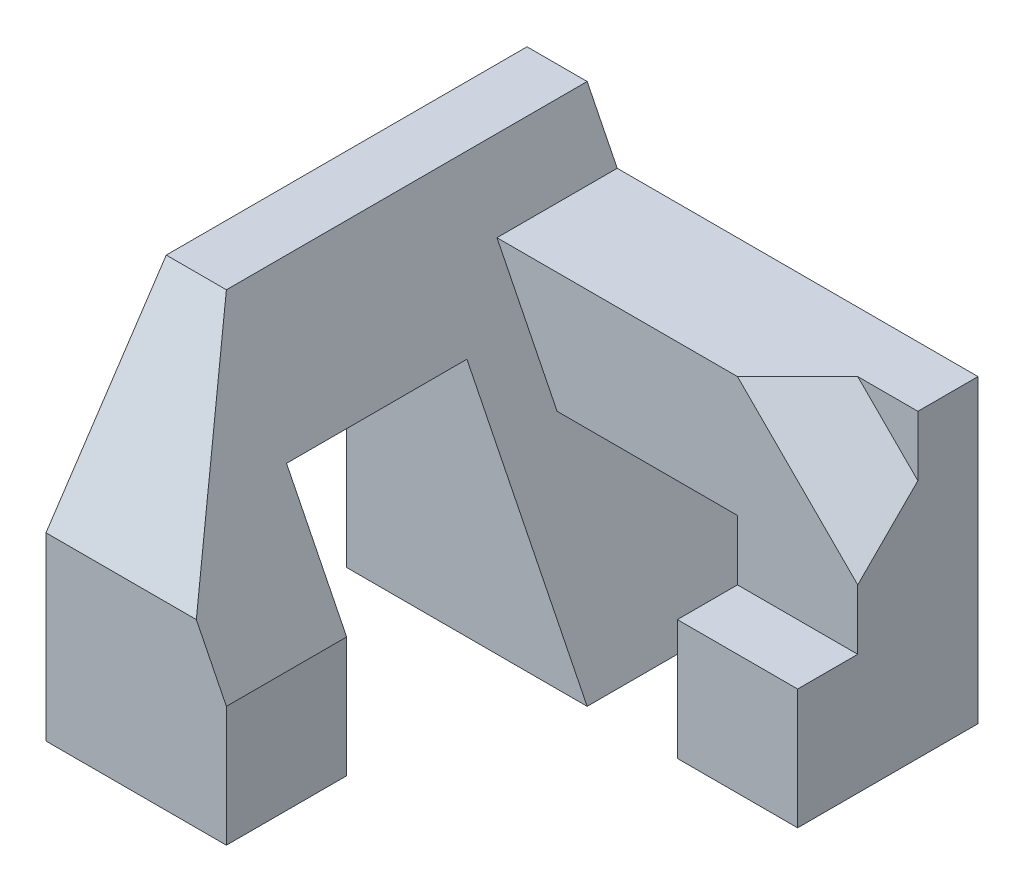
ISO-10303-21;
HEADER;
FILE_DESCRIPTION(('STEP AP214'),'2;1');
FILE_NAME('part.step','',(''),(''),'','','');
FILE_SCHEMA(('AUTOMOTIVE_DESIGN { 1 0 10303 214 1 1 1 1 }'));
ENDSEC;
DATA;
#1=APPLICATION_CONTEXT('core data for automotive mechanical design processes');
#2=APPLICATION_PROTOCOL_DEFINITION('international standard','automotive_design',2000,#1);
#3=PRODUCT_CONTEXT('',#1,'mechanical');
#4=PRODUCT('Part','Part','',(#3));
#5=PRODUCT_RELATED_PRODUCT_CATEGORY('part','',(#4));
#6=PRODUCT_DEFINITION_FORMATION('','',#4);
#7=PRODUCT_DEFINITION_CONTEXT('part definition',#1,'design');
#8=PRODUCT_DEFINITION('design','',#6,#7);
#9=PRODUCT_DEFINITION_SHAPE('','',#8);
#10=(LENGTH_UNIT() NAMED_UNIT(*) SI_UNIT(.MILLI.,.METRE.));
#11=(NAMED_UNIT(*) PLANE_ANGLE_UNIT() SI_UNIT($,.RADIAN.));
#12=(NAMED_UNIT(*) SI_UNIT($,.STERADIAN.) SOLID_ANGLE_UNIT());
#13=UNCERTAINTY_MEASURE_WITH_UNIT(LENGTH_MEASURE(1.E-05),#10,'distance_accuracy_value','');
#14=(GEOMETRIC_REPRESENTATION_CONTEXT(3) GLOBAL_UNCERTAINTY_ASSIGNED_CONTEXT((#13)) GLOBAL_UNIT_ASSIGNED_CONTEXT((#10,
#11,#12)) REPRESENTATION_CONTEXT('',''));
#15=CARTESIAN_POINT('',(0.,0.,0.));
#16=DIRECTION('',(0.,0.,1.));
#17=DIRECTION('',(1.,0.,0.));
#18=AXIS2_PLACEMENT_3D('',#15,#16,#17);
#19=CARTESIAN_POINT('',(4.,0.,2.));
#20=DIRECTION('',(0.,0.,-1.));
#21=DIRECTION('',(-1.,0.,0.));
#22=AXIS2_PLACEMENT_3D('',#19,#20,#21);
#23=PLANE('',#22);
#24=DIRECTION('',(0.,-1.,0.));
#25=VECTOR('',#24,1.);
#26=CARTESIAN_POINT('',(5.5,2.,2.));
#27=LINE('',#26,#25);
#28=CARTESIAN_POINT('',(5.5,0.,2.));
#29=VERTEX_POINT('',#28);
#30=CARTESIAN_POINT('',(5.5,-0.999999999999999,2.));
#31=VERTEX_POINT('',#30);
#32=EDGE_CURVE('E183',#29,#31,#27,.T.);
#33=ORIENTED_EDGE('',*,*,#32,.F.);
#34=DIRECTION('',(0.707106781186547,-0.707106781186548,0.));
#35=VECTOR('',#34,1.);
#36=CARTESIAN_POINT('',(3.5,2.,2.));
#37=LINE('',#36,#35);
#38=CARTESIAN_POINT('',(3.5,2.,2.));
#39=VERTEX_POINT('',#38);
#40=EDGE_CURVE('E172',#39,#29,#37,.T.);
#41=ORIENTED_EDGE('',*,*,#40,.F.);
#42=DIRECTION('',(-1.,0.,0.));
#43=VECTOR('',#42,1.);
#44=CARTESIAN_POINT('',(4.,2.,2.));
#45=LINE('',#44,#43);
#46=CARTESIAN_POINT('',(-0.5,2.,2.));
#47=VERTEX_POINT('',#46);
#48=EDGE_CURVE('E59',#39,#47,#45,.T.);
#49=ORIENTED_EDGE('',*,*,#48,.T.);
#50=DIRECTION('',(-0.447213595499958,0.894427190999916,0.));
#51=VECTOR('',#50,1.);
#52=CARTESIAN_POINT('',(0.4,0.2,2.));
#53=LINE('',#52,#51);
#54=CARTESIAN_POINT('',(0.5,0.,2.));
#55=VERTEX_POINT('',#54);
#56=EDGE_CURVE('E43',#55,#47,#53,.T.);
#57=ORIENTED_EDGE('',*,*,#56,.F.);
#58=DIRECTION('',(-1.,0.,0.));
#59=VECTOR('',#58,1.);
#60=CARTESIAN_POINT('',(4.,0.,2.));
#61=LINE('',#60,#59);
#62=CARTESIAN_POINT('',(3.5,0.,2.));
#63=VERTEX_POINT('',#62);
#64=EDGE_CURVE('E207',#63,#55,#61,.T.);
#65=ORIENTED_EDGE('',*,*,#64,.F.);
#66=DIRECTION('',(0.,1.,0.));
#67=VECTOR('',#66,1.);
#68=CARTESIAN_POINT('',(3.5,-3.,2.));
#69=LINE('',#68,#67);
#70=CARTESIAN_POINT('',(3.5,-1.,2.));
#71=VERTEX_POINT('',#70);
#72=EDGE_CURVE('E352',#71,#63,#69,.T.);
#73=ORIENTED_EDGE('',*,*,#72,.F.);
#74=DIRECTION('',(-1.,0.,0.));
#75=VECTOR('',#74,1.);
#76=CARTESIAN_POINT('',(5.5,-0.999999999999999,2.));
#77=LINE('',#76,#75);
#78=EDGE_CURVE('E189',#31,#71,#77,.T.);
#79=ORIENTED_EDGE('',*,*,#78,.F.);
#80=EDGE_LOOP('',(#33,#41,#49,#57,#65,#73,#79));
#81=FACE_BOUND('',#80,.T.);
#82=ADVANCED_FACE('F34',(#81),#23,.F.);
#83=CARTESIAN_POINT('',(4.,0.,0.));
#84=DIRECTION('',(0.,1.,0.));
#85=DIRECTION('',(-1.,0.,0.));
#86=AXIS2_PLACEMENT_3D('',#83,#84,#85);
#87=PLANE('',#86);
#88=DIRECTION('',(0.,0.,-1.));
#89=VECTOR('',#88,1.);
#90=CARTESIAN_POINT('',(3.5,0.,2.));
#91=LINE('',#90,#89);
#92=CARTESIAN_POINT('',(3.5,0.,0.));
#93=VERTEX_POINT('',#92);
#94=EDGE_CURVE('E351',#63,#93,#91,.T.);
#95=ORIENTED_EDGE('',*,*,#94,.F.);
#96=ORIENTED_EDGE('',*,*,#64,.T.);
#97=DIRECTION('',(0.,0.,1.));
#98=VECTOR('',#97,1.);
#99=CARTESIAN_POINT('',(0.499999999999999,0.,0.));
#100=LINE('',#99,#98);
#101=CARTESIAN_POINT('',(0.5,0.,0.));
#102=VERTEX_POINT('',#101);
#103=EDGE_CURVE('E285',#102,#55,#100,.T.);
#104=ORIENTED_EDGE('',*,*,#103,.F.);
#105=DIRECTION('',(-1.,0.,0.));
#106=VECTOR('',#105,1.);
#107=CARTESIAN_POINT('',(4.,0.,0.));
#108=LINE('',#107,#106);
#109=EDGE_CURVE('E194',#93,#102,#108,.T.);
#110=ORIENTED_EDGE('',*,*,#109,.F.);
#111=EDGE_LOOP('',(#95,#96,#104,#110));
#112=FACE_BOUND('',#111,.T.);
#113=ADVANCED_FACE('F350',(#112),#87,.F.);
#114=CARTESIAN_POINT('',(0.4,0.2,0.));
#115=DIRECTION('',(0.894427190999916,0.447213595499958,0.));
#116=DIRECTION('',(-0.447213595499958,0.894427190999916,0.));
#117=AXIS2_PLACEMENT_3D('',#114,#115,#116);
#118=PLANE('',#117);
#119=ORIENTED_EDGE('',*,*,#56,.T.);
#120=DIRECTION('',(0.,0.,-1.));
#121=VECTOR('',#120,1.);
#122=CARTESIAN_POINT('',(-0.5,2.,0.));
#123=LINE('',#122,#121);
#124=CARTESIAN_POINT('',(-0.5,2.,0.));
#125=VERTEX_POINT('',#124);
#126=EDGE_CURVE('E12',#47,#125,#123,.T.);
#127=ORIENTED_EDGE('',*,*,#126,.T.);
#128=DIRECTION('',(-0.447213595499958,0.894427190999916,0.));
#129=VECTOR('',#128,1.);
#130=CARTESIAN_POINT('',(2.,-3.,0.));
#131=LINE('',#130,#129);
#132=CARTESIAN_POINT('',(-1.,3.,0.));
#133=VERTEX_POINT('',#132);
#134=EDGE_CURVE('E241',#125,#133,#131,.T.);
#135=ORIENTED_EDGE('',*,*,#134,.T.);
#136=DIRECTION('',(0.,0.,1.));
#137=VECTOR('',#136,1.);
#138=CARTESIAN_POINT('',(-1.,3.,0.));
#139=LINE('',#138,#137);
#140=CARTESIAN_POINT('',(-0.999999999999997,3.,6.));
#141=VERTEX_POINT('',#140);
#142=EDGE_CURVE('E246',#133,#141,#139,.T.);
#143=ORIENTED_EDGE('',*,*,#142,.T.);
#144=DIRECTION('',(-0.384110639798688,0.768221279597376,-0.512147519731584));
#145=VECTOR('',#144,1.);
#146=CARTESIAN_POINT('',(-1.14754098360656,3.29508196721311,5.80327868852459));
#147=LINE('',#146,#145);
#148=CARTESIAN_POINT('',(0.500000000000003,0.,8.));
#149=VERTEX_POINT('',#148);
#150=EDGE_CURVE('E283',#149,#141,#147,.T.);
#151=ORIENTED_EDGE('',*,*,#150,.F.);
#152=DIRECTION('',(0.447213595499958,-0.894427190999916,0.));
#153=VECTOR('',#152,1.);
#154=CARTESIAN_POINT('',(-0.999999999999999,3.,8.));
#155=LINE('',#154,#153);
#156=CARTESIAN_POINT('',(0.999999999999999,-0.999999999999992,8.));
#157=VERTEX_POINT('',#156);
#158=EDGE_CURVE('E249',#149,#157,#155,.T.);
#159=ORIENTED_EDGE('',*,*,#158,.T.);
#160=DIRECTION('',(0.,0.,1.));
#161=VECTOR('',#160,1.);
#162=CARTESIAN_POINT('',(1.,-1.,0.));
#163=LINE('',#162,#161);
#164=CARTESIAN_POINT('',(1.,-0.999999999999997,6.));
#165=VERTEX_POINT('',#164);
#166=EDGE_CURVE('E230',#165,#157,#163,.T.);
#167=ORIENTED_EDGE('',*,*,#166,.F.);
#168=DIRECTION('',(0.447213595499958,-0.894427190999916,0.));
#169=VECTOR('',#168,1.);
#170=CARTESIAN_POINT('',(0.400000000000001,0.200000000000001,6.));
#171=LINE('',#170,#169);
#172=CARTESIAN_POINT('',(0.,1.,6.));
#173=VERTEX_POINT('',#172);
#174=EDGE_CURVE('E272',#173,#165,#171,.T.);
#175=ORIENTED_EDGE('',*,*,#174,.F.);
#176=DIRECTION('',(0.,0.,1.));
#177=VECTOR('',#176,1.);
#178=CARTESIAN_POINT('',(0.,1.,0.));
#179=LINE('',#178,#177);
#180=CARTESIAN_POINT('',(0.,1.,3.));
#181=VERTEX_POINT('',#180);
#182=EDGE_CURVE('E280',#181,#173,#179,.T.);
#183=ORIENTED_EDGE('',*,*,#182,.F.);
#184=DIRECTION('',(-0.447213595499958,0.894427190999916,0.));
#185=VECTOR('',#184,1.);
#186=CARTESIAN_POINT('',(0.400000000000001,0.2,3.));
#187=LINE('',#186,#185);
#188=CARTESIAN_POINT('',(2.,-3.,3.));
#189=VERTEX_POINT('',#188);
#190=EDGE_CURVE('E275',#189,#181,#187,.T.);
#191=ORIENTED_EDGE('',*,*,#190,.F.);
#192=DIRECTION('',(0.,0.,-1.));
#193=VECTOR('',#192,1.);
#194=CARTESIAN_POINT('',(2.,-3.,8.));
#195=LINE('',#194,#193);
#196=CARTESIAN_POINT('',(2.,-3.,0.));
#197=VERTEX_POINT('',#196);
#198=EDGE_CURVE('E266',#189,#197,#195,.T.);
#199=ORIENTED_EDGE('',*,*,#198,.T.);
#200=EDGE_CURVE('E243',#197,#102,#131,.T.);
#201=ORIENTED_EDGE('',*,*,#200,.T.);
#202=ORIENTED_EDGE('',*,*,#103,.T.);
#203=EDGE_LOOP('',(#119,#127,#135,#143,#151,#159,#167,#175,#183,#191,#199,#201,#202));
#204=FACE_BOUND('',#203,.T.);
#205=ADVANCED_FACE('F289',(#204),#118,.T.);
#206=CARTESIAN_POINT('',(2.,-3.,8.));
#207=DIRECTION('',(0.,1.,0.));
#208=DIRECTION('',(-1.,0.,0.));
#209=AXIS2_PLACEMENT_3D('',#206,#207,#208);
#210=PLANE('',#209);
#211=ORIENTED_EDGE('',*,*,#198,.F.);
#212=DIRECTION('',(-1.,0.,0.));
#213=VECTOR('',#212,1.);
#214=CARTESIAN_POINT('',(2.,-3.,3.));
#215=LINE('',#214,#213);
#216=CARTESIAN_POINT('',(-2.,-3.,3.));
#217=VERTEX_POINT('',#216);
#218=EDGE_CURVE('E238',#189,#217,#215,.T.);
#219=ORIENTED_EDGE('',*,*,#218,.T.);
#220=DIRECTION('',(0.,0.,-1.));
#221=VECTOR('',#220,1.);
#222=CARTESIAN_POINT('',(-2.,-3.,8.));
#223=LINE('',#222,#221);
#224=CARTESIAN_POINT('',(-2.,-3.,0.));
#225=VERTEX_POINT('',#224);
#226=EDGE_CURVE('E268',#217,#225,#223,.T.);
#227=ORIENTED_EDGE('',*,*,#226,.T.);
#228=DIRECTION('',(1.,0.,0.));
#229=VECTOR('',#228,1.);
#230=CARTESIAN_POINT('',(2.,-3.,0.));
#231=LINE('',#230,#229);
#232=EDGE_CURVE('E260',#225,#197,#231,.T.);
#233=ORIENTED_EDGE('',*,*,#232,.T.);
#234=EDGE_LOOP('',(#211,#219,#227,#233));
#235=FACE_BOUND('',#234,.T.);
#236=ADVANCED_FACE('F343',(#235),#210,.F.);
#237=CARTESIAN_POINT('',(2.,3.,8.));
#238=DIRECTION('',(0.,-1.,0.));
#239=DIRECTION('',(1.,0.,0.));
#240=AXIS2_PLACEMENT_3D('',#237,#238,#239);
#241=PLANE('',#240);
#242=DIRECTION('',(0.,0.,-1.));
#243=VECTOR('',#242,1.);
#244=CARTESIAN_POINT('',(-2.,3.,8.));
#245=LINE('',#244,#243);
#246=CARTESIAN_POINT('',(-2.,3.,6.));
#247=VERTEX_POINT('',#246);
#248=CARTESIAN_POINT('',(-2.,3.,0.));
#249=VERTEX_POINT('',#248);
#250=EDGE_CURVE('E258',#247,#249,#245,.T.);
#251=ORIENTED_EDGE('',*,*,#250,.F.);
#252=DIRECTION('',(-1.,0.,0.));
#253=VECTOR('',#252,1.);
#254=CARTESIAN_POINT('',(2.,3.,6.));
#255=LINE('',#254,#253);
#256=EDGE_CURVE('E212',#141,#247,#255,.T.);
#257=ORIENTED_EDGE('',*,*,#256,.F.);
#258=ORIENTED_EDGE('',*,*,#142,.F.);
#259=DIRECTION('',(-1.,0.,0.));
#260=VECTOR('',#259,1.);
#261=CARTESIAN_POINT('',(2.,3.,0.));
#262=LINE('',#261,#260);
#263=EDGE_CURVE('E255',#133,#249,#262,.T.);
#264=ORIENTED_EDGE('',*,*,#263,.T.);
#265=EDGE_LOOP('',(#251,#257,#258,#264));
#266=FACE_BOUND('',#265,.T.);
#267=ADVANCED_FACE('F309',(#266),#241,.F.);
#268=CARTESIAN_POINT('',(0.,0.,8.));
#269=DIRECTION('',(0.,0.,1.));
#270=DIRECTION('',(1.,0.,0.));
#271=AXIS2_PLACEMENT_3D('',#268,#269,#270);
#272=PLANE('',#271);
#273=DIRECTION('',(-1.,0.,0.));
#274=VECTOR('',#273,1.);
#275=CARTESIAN_POINT('',(2.,0.,8.));
#276=LINE('',#275,#274);
#277=CARTESIAN_POINT('',(-2.,0.,8.));
#278=VERTEX_POINT('',#277);
#279=EDGE_CURVE('E213',#149,#278,#276,.T.);
#280=ORIENTED_EDGE('',*,*,#279,.T.);
#281=DIRECTION('',(0.,-1.,0.));
#282=VECTOR('',#281,1.);
#283=CARTESIAN_POINT('',(-2.,-3.,8.));
#284=LINE('',#283,#282);
#285=CARTESIAN_POINT('',(-2.,-3.,8.));
#286=VERTEX_POINT('',#285);
#287=EDGE_CURVE('E252',#278,#286,#284,.T.);
#288=ORIENTED_EDGE('',*,*,#287,.T.);
#289=DIRECTION('',(1.,0.,0.));
#290=VECTOR('',#289,1.);
#291=CARTESIAN_POINT('',(2.,-3.,8.));
#292=LINE('',#291,#290);
#293=CARTESIAN_POINT('',(1.,-3.,8.));
#294=VERTEX_POINT('',#293);
#295=EDGE_CURVE('E254',#286,#294,#292,.T.);
#296=ORIENTED_EDGE('',*,*,#295,.T.);
#297=DIRECTION('',(0.,-1.,0.));
#298=VECTOR('',#297,1.);
#299=CARTESIAN_POINT('',(1.,3.,8.));
#300=LINE('',#299,#298);
#301=EDGE_CURVE('E228',#157,#294,#300,.T.);
#302=ORIENTED_EDGE('',*,*,#301,.F.);
#303=ORIENTED_EDGE('',*,*,#158,.F.);
#304=EDGE_LOOP('',(#280,#288,#296,#302,#303));
#305=FACE_BOUND('',#304,.T.);
#306=ADVANCED_FACE('F319',(#305),#272,.T.);
#307=CARTESIAN_POINT('',(0.,0.,0.));
#308=DIRECTION('',(0.,0.,1.));
#309=DIRECTION('',(1.,0.,0.));
#310=AXIS2_PLACEMENT_3D('',#307,#308,#309);
#311=PLANE('',#310);
#312=ORIENTED_EDGE('',*,*,#232,.F.);
#313=DIRECTION('',(0.,-1.,0.));
#314=VECTOR('',#313,1.);
#315=CARTESIAN_POINT('',(-2.,-3.,0.));
#316=LINE('',#315,#314);
#317=EDGE_CURVE('E251',#249,#225,#316,.T.);
#318=ORIENTED_EDGE('',*,*,#317,.F.);
#319=ORIENTED_EDGE('',*,*,#263,.F.);
#320=ORIENTED_EDGE('',*,*,#134,.F.);
#321=DIRECTION('',(-1.,0.,0.));
#322=VECTOR('',#321,1.);
#323=CARTESIAN_POINT('',(4.,2.,0.));
#324=LINE('',#323,#322);
#325=CARTESIAN_POINT('',(5.5,2.,0.));
#326=VERTEX_POINT('',#325);
#327=EDGE_CURVE('E190',#326,#125,#324,.T.);
#328=ORIENTED_EDGE('',*,*,#327,.F.);
#329=DIRECTION('',(0.,1.,0.));
#330=VECTOR('',#329,1.);
#331=CARTESIAN_POINT('',(5.5,0.,0.));
#332=LINE('',#331,#330);
#333=CARTESIAN_POINT('',(5.5,-3.,0.));
#334=VERTEX_POINT('',#333);
#335=EDGE_CURVE('E196',#334,#326,#332,.T.);
#336=ORIENTED_EDGE('',*,*,#335,.F.);
#337=DIRECTION('',(1.,0.,0.));
#338=VECTOR('',#337,1.);
#339=CARTESIAN_POINT('',(3.5,-3.,0.));
#340=LINE('',#339,#338);
#341=CARTESIAN_POINT('',(3.5,-3.,0.));
#342=VERTEX_POINT('',#341);
#343=EDGE_CURVE('E357',#342,#334,#340,.T.);
#344=ORIENTED_EDGE('',*,*,#343,.F.);
#345=DIRECTION('',(0.,1.,0.));
#346=VECTOR('',#345,1.);
#347=CARTESIAN_POINT('',(3.5,-3.,0.));
#348=LINE('',#347,#346);
#349=EDGE_CURVE('E355',#342,#93,#348,.T.);
#350=ORIENTED_EDGE('',*,*,#349,.T.);
#351=ORIENTED_EDGE('',*,*,#109,.T.);
#352=ORIENTED_EDGE('',*,*,#200,.F.);
#353=EDGE_LOOP('',(#312,#318,#319,#320,#328,#336,#344,#350,#351,#352));
#354=FACE_BOUND('',#353,.T.);
#355=ADVANCED_FACE('F299',(#354),#311,.F.);
#356=CARTESIAN_POINT('',(-2.,-3.,8.));
#357=DIRECTION('',(1.,0.,0.));
#358=DIRECTION('',(0.,0.,-1.));
#359=AXIS2_PLACEMENT_3D('',#356,#357,#358);
#360=PLANE('',#359);
#361=ORIENTED_EDGE('',*,*,#317,.T.);
#362=ORIENTED_EDGE('',*,*,#226,.F.);
#363=DIRECTION('',(0.,-1.,0.));
#364=VECTOR('',#363,1.);
#365=CARTESIAN_POINT('',(-2.,-3.,3.));
#366=LINE('',#365,#364);
#367=CARTESIAN_POINT('',(-2.,1.,3.));
#368=VERTEX_POINT('',#367);
#369=EDGE_CURVE('E235',#368,#217,#366,.T.);
#370=ORIENTED_EDGE('',*,*,#369,.F.);
#371=DIRECTION('',(0.,0.,-1.));
#372=VECTOR('',#371,1.);
#373=CARTESIAN_POINT('',(-2.,1.,3.));
#374=LINE('',#373,#372);
#375=CARTESIAN_POINT('',(-2.,1.,6.));
#376=VERTEX_POINT('',#375);
#377=EDGE_CURVE('E216',#376,#368,#374,.T.);
#378=ORIENTED_EDGE('',*,*,#377,.F.);
#379=DIRECTION('',(0.,1.,0.));
#380=VECTOR('',#379,1.);
#381=CARTESIAN_POINT('',(-2.,0.,6.));
#382=LINE('',#381,#380);
#383=CARTESIAN_POINT('',(-2.,-3.,6.));
#384=VERTEX_POINT('',#383);
#385=EDGE_CURVE('E233',#384,#376,#382,.T.);
#386=ORIENTED_EDGE('',*,*,#385,.F.);
#387=EDGE_CURVE('E269',#286,#384,#223,.T.);
#388=ORIENTED_EDGE('',*,*,#387,.F.);
#389=ORIENTED_EDGE('',*,*,#287,.F.);
#390=DIRECTION('',(0.,-0.832050294337844,0.554700196225229));
#391=VECTOR('',#390,1.);
#392=CARTESIAN_POINT('',(-2.,3.,6.));
#393=LINE('',#392,#391);
#394=EDGE_CURVE('E210',#247,#278,#393,.T.);
#395=ORIENTED_EDGE('',*,*,#394,.F.);
#396=ORIENTED_EDGE('',*,*,#250,.T.);
#397=EDGE_LOOP('',(#361,#362,#370,#378,#386,#388,#389,#395,#396));
#398=FACE_BOUND('',#397,.T.);
#399=ADVANCED_FACE('F36',(#398),#360,.F.);
#400=DIRECTION('',(-1.,0.,0.));
#401=VECTOR('',#400,1.);
#402=CARTESIAN_POINT('',(2.,-3.,6.));
#403=LINE('',#402,#401);
#404=CARTESIAN_POINT('',(1.,-3.,6.));
#405=VERTEX_POINT('',#404);
#406=EDGE_CURVE('E237',#405,#384,#403,.T.);
#407=ORIENTED_EDGE('',*,*,#406,.F.);
#408=DIRECTION('',(0.,0.,-1.));
#409=VECTOR('',#408,1.);
#410=CARTESIAN_POINT('',(1.,-3.,8.));
#411=LINE('',#410,#409);
#412=EDGE_CURVE('E224',#294,#405,#411,.T.);
#413=ORIENTED_EDGE('',*,*,#412,.F.);
#414=ORIENTED_EDGE('',*,*,#295,.F.);
#415=ORIENTED_EDGE('',*,*,#387,.T.);
#416=EDGE_LOOP('',(#407,#413,#414,#415));
#417=FACE_BOUND('',#416,.T.);
#418=ADVANCED_FACE('F325',(#417),#210,.F.);
#419=CARTESIAN_POINT('',(2.,-3.,3.));
#420=DIRECTION('',(0.,0.,-1.));
#421=DIRECTION('',(-1.,0.,0.));
#422=AXIS2_PLACEMENT_3D('',#419,#420,#421);
#423=PLANE('',#422);
#424=ORIENTED_EDGE('',*,*,#190,.T.);
#425=DIRECTION('',(-1.,0.,0.));
#426=VECTOR('',#425,1.);
#427=CARTESIAN_POINT('',(2.,1.,3.));
#428=LINE('',#427,#426);
#429=EDGE_CURVE('E221',#181,#368,#428,.T.);
#430=ORIENTED_EDGE('',*,*,#429,.T.);
#431=ORIENTED_EDGE('',*,*,#369,.T.);
#432=ORIENTED_EDGE('',*,*,#218,.F.);
#433=EDGE_LOOP('',(#424,#430,#431,#432));
#434=FACE_BOUND('',#433,.T.);
#435=ADVANCED_FACE('F339',(#434),#423,.F.);
#436=CARTESIAN_POINT('',(2.,0.,6.));
#437=DIRECTION('',(0.,0.,1.));
#438=DIRECTION('',(1.,0.,0.));
#439=AXIS2_PLACEMENT_3D('',#436,#437,#438);
#440=PLANE('',#439);
#441=ORIENTED_EDGE('',*,*,#174,.T.);
#442=DIRECTION('',(0.,-1.,0.));
#443=VECTOR('',#442,1.);
#444=CARTESIAN_POINT('',(1.,0.,6.));
#445=LINE('',#444,#443);
#446=EDGE_CURVE('E277',#165,#405,#445,.T.);
#447=ORIENTED_EDGE('',*,*,#446,.T.);
#448=ORIENTED_EDGE('',*,*,#406,.T.);
#449=ORIENTED_EDGE('',*,*,#385,.T.);
#450=DIRECTION('',(-1.,0.,0.));
#451=VECTOR('',#450,1.);
#452=CARTESIAN_POINT('',(2.,1.,6.));
#453=LINE('',#452,#451);
#454=EDGE_CURVE('E220',#173,#376,#453,.T.);
#455=ORIENTED_EDGE('',*,*,#454,.F.);
#456=EDGE_LOOP('',(#441,#447,#448,#449,#455));
#457=FACE_BOUND('',#456,.T.);
#458=ADVANCED_FACE('F330',(#457),#440,.F.);
#459=CARTESIAN_POINT('',(1.,3.,8.));
#460=DIRECTION('',(-1.,0.,0.));
#461=DIRECTION('',(0.,-1.,0.));
#462=AXIS2_PLACEMENT_3D('',#459,#460,#461);
#463=PLANE('',#462);
#464=ORIENTED_EDGE('',*,*,#166,.T.);
#465=ORIENTED_EDGE('',*,*,#301,.T.);
#466=ORIENTED_EDGE('',*,*,#412,.T.);
#467=ORIENTED_EDGE('',*,*,#446,.F.);
#468=EDGE_LOOP('',(#464,#465,#466,#467));
#469=FACE_BOUND('',#468,.T.);
#470=ADVANCED_FACE('F327',(#469),#463,.F.);
#471=CARTESIAN_POINT('',(2.,1.,3.));
#472=DIRECTION('',(0.,1.,0.));
#473=DIRECTION('',(0.,0.,1.));
#474=AXIS2_PLACEMENT_3D('',#471,#472,#473);
#475=PLANE('',#474);
#476=ORIENTED_EDGE('',*,*,#182,.T.);
#477=ORIENTED_EDGE('',*,*,#454,.T.);
#478=ORIENTED_EDGE('',*,*,#377,.T.);
#479=ORIENTED_EDGE('',*,*,#429,.F.);
#480=EDGE_LOOP('',(#476,#477,#478,#479));
#481=FACE_BOUND('',#480,.T.);
#482=ADVANCED_FACE('F336',(#481),#475,.F.);
#483=CARTESIAN_POINT('',(2.,3.,6.));
#484=DIRECTION('',(0.,-0.554700196225229,-0.832050294337844));
#485=DIRECTION('',(0.,0.832050294337844,-0.554700196225229));
#486=AXIS2_PLACEMENT_3D('',#483,#484,#485);
#487=PLANE('',#486);
#488=ORIENTED_EDGE('',*,*,#150,.T.);
#489=ORIENTED_EDGE('',*,*,#256,.T.);
#490=ORIENTED_EDGE('',*,*,#394,.T.);
#491=ORIENTED_EDGE('',*,*,#279,.F.);
#492=EDGE_LOOP('',(#488,#489,#490,#491));
#493=FACE_BOUND('',#492,.T.);
#494=ADVANCED_FACE('F312',(#493),#487,.F.);
#495=CARTESIAN_POINT('',(4.,2.,0.));
#496=DIRECTION('',(0.,-1.,0.));
#497=DIRECTION('',(1.,0.,0.));
#498=AXIS2_PLACEMENT_3D('',#495,#496,#497);
#499=PLANE('',#498);
#500=ORIENTED_EDGE('',*,*,#48,.F.);
#501=DIRECTION('',(-0.707106781186547,0.,0.707106781186548));
#502=VECTOR('',#501,1.);
#503=CARTESIAN_POINT('',(4.5,2.,1.));
#504=LINE('',#503,#502);
#505=CARTESIAN_POINT('',(4.5,2.,1.));
#506=VERTEX_POINT('',#505);
#507=EDGE_CURVE('E175',#506,#39,#504,.T.);
#508=ORIENTED_EDGE('',*,*,#507,.F.);
#509=DIRECTION('',(-1.,0.,0.));
#510=VECTOR('',#509,1.);
#511=CARTESIAN_POINT('',(4.5,2.,1.));
#512=LINE('',#511,#510);
#513=CARTESIAN_POINT('',(5.5,2.,1.));
#514=VERTEX_POINT('',#513);
#515=EDGE_CURVE('E565',#514,#506,#512,.T.);
#516=ORIENTED_EDGE('',*,*,#515,.F.);
#517=DIRECTION('',(0.,0.,1.));
#518=VECTOR('',#517,1.);
#519=CARTESIAN_POINT('',(5.5,2.,0.));
#520=LINE('',#519,#518);
#521=EDGE_CURVE('E191',#326,#514,#520,.T.);
#522=ORIENTED_EDGE('',*,*,#521,.F.);
#523=ORIENTED_EDGE('',*,*,#327,.T.);
#524=ORIENTED_EDGE('',*,*,#126,.F.);
#525=EDGE_LOOP('',(#500,#508,#516,#522,#523,#524));
#526=FACE_BOUND('',#525,.T.);
#527=ADVANCED_FACE('F293',(#526),#499,.F.);
#528=CARTESIAN_POINT('',(5.5,0.,0.));
#529=DIRECTION('',(1.,0.,0.));
#530=DIRECTION('',(0.,1.,0.));
#531=AXIS2_PLACEMENT_3D('',#528,#529,#530);
#532=PLANE('',#531);
#533=DIRECTION('',(0.,0.707106781186548,-0.707106781186547));
#534=VECTOR('',#533,1.);
#535=CARTESIAN_POINT('',(5.5,0.,2.));
#536=LINE('',#535,#534);
#537=CARTESIAN_POINT('',(5.5,1.,1.));
#538=VERTEX_POINT('',#537);
#539=EDGE_CURVE('E51',#29,#538,#536,.T.);
#540=ORIENTED_EDGE('',*,*,#539,.F.);
#541=ORIENTED_EDGE('',*,*,#32,.T.);
#542=DIRECTION('',(0.,0.,-1.));
#543=VECTOR('',#542,1.);
#544=CARTESIAN_POINT('',(5.5,-0.999999999999999,3.));
#545=LINE('',#544,#543);
#546=CARTESIAN_POINT('',(5.5,-0.999999999999999,3.));
#547=VERTEX_POINT('',#546);
#548=EDGE_CURVE('E362',#547,#31,#545,.T.);
#549=ORIENTED_EDGE('',*,*,#548,.F.);
#550=DIRECTION('',(0.,1.,0.));
#551=VECTOR('',#550,1.);
#552=CARTESIAN_POINT('',(5.5,-3.,3.));
#553=LINE('',#552,#551);
#554=CARTESIAN_POINT('',(5.5,-3.,3.));
#555=VERTEX_POINT('',#554);
#556=EDGE_CURVE('E378',#555,#547,#553,.T.);
#557=ORIENTED_EDGE('',*,*,#556,.F.);
#558=DIRECTION('',(0.,0.,1.));
#559=VECTOR('',#558,1.);
#560=CARTESIAN_POINT('',(5.5,-3.,0.));
#561=LINE('',#560,#559);
#562=EDGE_CURVE('E361',#334,#555,#561,.T.);
#563=ORIENTED_EDGE('',*,*,#562,.F.);
#564=ORIENTED_EDGE('',*,*,#335,.T.);
#565=ORIENTED_EDGE('',*,*,#521,.T.);
#566=DIRECTION('',(0.,1.,0.));
#567=VECTOR('',#566,1.);
#568=CARTESIAN_POINT('',(5.5,2.,1.));
#569=LINE('',#568,#567);
#570=EDGE_CURVE('E177',#538,#514,#569,.T.);
#571=ORIENTED_EDGE('',*,*,#570,.F.);
#572=EDGE_LOOP('',(#540,#541,#549,#557,#563,#564,#565,#571));
#573=FACE_BOUND('',#572,.T.);
#574=ADVANCED_FACE('F181',(#573),#532,.T.);
#575=CARTESIAN_POINT('',(3.5,-3.,2.));
#576=DIRECTION('',(1.,0.,0.));
#577=DIRECTION('',(0.,0.,-1.));
#578=AXIS2_PLACEMENT_3D('',#575,#576,#577);
#579=PLANE('',#578);
#580=ORIENTED_EDGE('',*,*,#94,.T.);
#581=ORIENTED_EDGE('',*,*,#349,.F.);
#582=DIRECTION('',(0.,0.,-1.));
#583=VECTOR('',#582,1.);
#584=CARTESIAN_POINT('',(3.5,-3.,2.));
#585=LINE('',#584,#583);
#586=CARTESIAN_POINT('',(3.5,-3.,3.));
#587=VERTEX_POINT('',#586);
#588=EDGE_CURVE('E364',#587,#342,#585,.T.);
#589=ORIENTED_EDGE('',*,*,#588,.F.);
#590=DIRECTION('',(0.,-1.,0.));
#591=VECTOR('',#590,1.);
#592=CARTESIAN_POINT('',(3.5,-1.,3.));
#593=LINE('',#592,#591);
#594=CARTESIAN_POINT('',(3.5,-1.,3.));
#595=VERTEX_POINT('',#594);
#596=EDGE_CURVE('E370',#595,#587,#593,.T.);
#597=ORIENTED_EDGE('',*,*,#596,.F.);
#598=DIRECTION('',(0.,0.,-1.));
#599=VECTOR('',#598,1.);
#600=CARTESIAN_POINT('',(3.5,-1.,3.));
#601=LINE('',#600,#599);
#602=EDGE_CURVE('E368',#595,#71,#601,.T.);
#603=ORIENTED_EDGE('',*,*,#602,.T.);
#604=ORIENTED_EDGE('',*,*,#72,.T.);
#605=EDGE_LOOP('',(#580,#581,#589,#597,#603,#604));
#606=FACE_BOUND('',#605,.T.);
#607=ADVANCED_FACE('F401',(#606),#579,.F.);
#608=CARTESIAN_POINT('',(0.,-3.,0.));
#609=DIRECTION('',(0.,-1.,0.));
#610=DIRECTION('',(1.,0.,0.));
#611=AXIS2_PLACEMENT_3D('',#608,#609,#610);
#612=PLANE('',#611);
#613=ORIENTED_EDGE('',*,*,#562,.T.);
#614=DIRECTION('',(1.,0.,0.));
#615=VECTOR('',#614,1.);
#616=CARTESIAN_POINT('',(3.5,-3.,3.));
#617=LINE('',#616,#615);
#618=EDGE_CURVE('E372',#587,#555,#617,.T.);
#619=ORIENTED_EDGE('',*,*,#618,.F.);
#620=ORIENTED_EDGE('',*,*,#588,.T.);
#621=ORIENTED_EDGE('',*,*,#343,.T.);
#622=EDGE_LOOP('',(#613,#619,#620,#621));
#623=FACE_BOUND('',#622,.T.);
#624=ADVANCED_FACE('F394',(#623),#612,.T.);
#625=CARTESIAN_POINT('',(5.5,-0.999999999999999,3.));
#626=DIRECTION('',(0.,-1.,0.));
#627=DIRECTION('',(1.,0.,0.));
#628=AXIS2_PLACEMENT_3D('',#625,#626,#627);
#629=PLANE('',#628);
#630=ORIENTED_EDGE('',*,*,#78,.T.);
#631=ORIENTED_EDGE('',*,*,#602,.F.);
#632=DIRECTION('',(-1.,0.,0.));
#633=VECTOR('',#632,1.);
#634=CARTESIAN_POINT('',(5.5,-0.999999999999999,3.));
#635=LINE('',#634,#633);
#636=EDGE_CURVE('E376',#547,#595,#635,.T.);
#637=ORIENTED_EDGE('',*,*,#636,.F.);
#638=ORIENTED_EDGE('',*,*,#548,.T.);
#639=EDGE_LOOP('',(#630,#631,#637,#638));
#640=FACE_BOUND('',#639,.T.);
#641=ADVANCED_FACE('F400',(#640),#629,.F.);
#642=CARTESIAN_POINT('',(0.,0.,3.));
#643=DIRECTION('',(0.,0.,1.));
#644=DIRECTION('',(1.,0.,0.));
#645=AXIS2_PLACEMENT_3D('',#642,#643,#644);
#646=PLANE('',#645);
#647=ORIENTED_EDGE('',*,*,#618,.T.);
#648=ORIENTED_EDGE('',*,*,#556,.T.);
#649=ORIENTED_EDGE('',*,*,#636,.T.);
#650=ORIENTED_EDGE('',*,*,#596,.T.);
#651=EDGE_LOOP('',(#647,#648,#649,#650));
#652=FACE_BOUND('',#651,.T.);
#653=ADVANCED_FACE('F390',(#652),#646,.T.);
#654=CARTESIAN_POINT('',(0.,0.,1.));
#655=DIRECTION('',(0.,0.,1.));
#656=DIRECTION('',(1.,0.,0.));
#657=AXIS2_PLACEMENT_3D('',#654,#655,#656);
#658=PLANE('',#657);
#659=ORIENTED_EDGE('',*,*,#570,.T.);
#660=ORIENTED_EDGE('',*,*,#515,.T.);
#661=DIRECTION('',(0.707106781186547,-0.707106781186548,0.));
#662=VECTOR('',#661,1.);
#663=CARTESIAN_POINT('',(5.5,1.,1.));
#664=LINE('',#663,#662);
#665=EDGE_CURVE('E373',#506,#538,#664,.T.);
#666=ORIENTED_EDGE('',*,*,#665,.T.);
#667=EDGE_LOOP('',(#659,#660,#666));
#668=FACE_BOUND('',#667,.T.);
#669=ADVANCED_FACE('F534',(#668),#658,.T.);
#670=CARTESIAN_POINT('',(2.5,2.49999999999999,2.50000000000001));
#671=DIRECTION('',(-0.577350269189626,-0.577350269189624,-0.577350269189628));
#672=DIRECTION('',(-0.707106781186549,0.,0.707106781186547));
#673=AXIS2_PLACEMENT_3D('',#670,#671,#672);
#674=PLANE('',#673);
#675=ORIENTED_EDGE('',*,*,#40,.T.);
#676=ORIENTED_EDGE('',*,*,#539,.T.);
#677=ORIENTED_EDGE('',*,*,#665,.F.);
#678=ORIENTED_EDGE('',*,*,#507,.T.);
#679=EDGE_LOOP('',(#675,#676,#677,#678));
#680=FACE_BOUND('',#679,.T.);
#681=ADVANCED_FACE('F173',(#680),#674,.F.);
#682=CLOSED_SHELL('',(#82,#113,#205,#236,#267,#306,#355,#399,#418,#435,#458,#470,#482,#494,#527,
#574,#607,#624,#641,#653,#669,#681));
#683=MANIFOLD_SOLID_BREP('B2',#682);
#684=ADVANCED_BREP_SHAPE_REPRESENTATION('',(#18,#683),#14);
#685=SHAPE_DEFINITION_REPRESENTATION(#9,#684);
ENDSEC;
END-ISO-10303-21;
